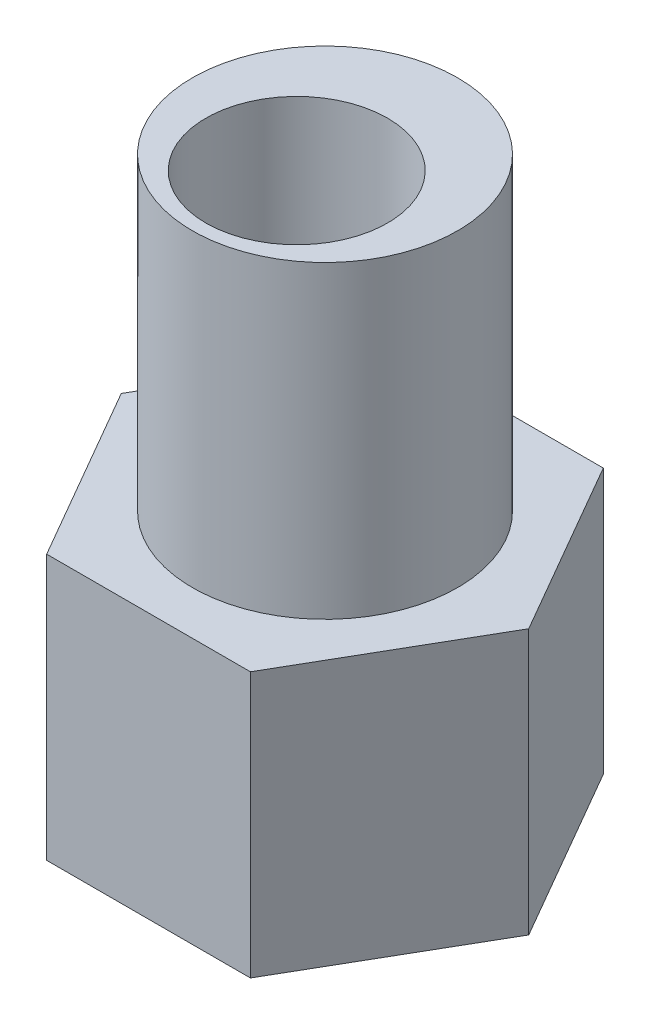
ISO-10303-21;
HEADER;
FILE_DESCRIPTION(('STEP AP214'),'2;1');
FILE_NAME('part.step','',(''),(''),'','','');
FILE_SCHEMA(('AUTOMOTIVE_DESIGN { 1 0 10303 214 1 1 1 1 }'));
ENDSEC;
DATA;
#1=APPLICATION_CONTEXT('core data for automotive mechanical design processes');
#2=APPLICATION_PROTOCOL_DEFINITION('international standard','automotive_design',2000,#1);
#3=PRODUCT_CONTEXT('',#1,'mechanical');
#4=PRODUCT('Part','Part','',(#3));
#5=PRODUCT_RELATED_PRODUCT_CATEGORY('part','',(#4));
#6=PRODUCT_DEFINITION_FORMATION('','',#4);
#7=PRODUCT_DEFINITION_CONTEXT('part definition',#1,'design');
#8=PRODUCT_DEFINITION('design','',#6,#7);
#9=PRODUCT_DEFINITION_SHAPE('','',#8);
#10=(LENGTH_UNIT() NAMED_UNIT(*) SI_UNIT(.MILLI.,.METRE.));
#11=(NAMED_UNIT(*) PLANE_ANGLE_UNIT() SI_UNIT($,.RADIAN.));
#12=(NAMED_UNIT(*) SI_UNIT($,.STERADIAN.) SOLID_ANGLE_UNIT());
#13=UNCERTAINTY_MEASURE_WITH_UNIT(LENGTH_MEASURE(1.E-05),#10,'distance_accuracy_value','');
#14=(GEOMETRIC_REPRESENTATION_CONTEXT(3) GLOBAL_UNCERTAINTY_ASSIGNED_CONTEXT((#13)) GLOBAL_UNIT_ASSIGNED_CONTEXT((#10,
#11,#12)) REPRESENTATION_CONTEXT('',''));
#15=CARTESIAN_POINT('',(0.,0.,0.));
#16=DIRECTION('',(0.,0.,1.));
#17=DIRECTION('',(1.,0.,0.));
#18=AXIS2_PLACEMENT_3D('',#15,#16,#17);
#19=CARTESIAN_POINT('',(0.,9.525,0.));
#20=DIRECTION('',(0.,1.,0.));
#21=DIRECTION('',(0.,0.,1.));
#22=AXIS2_PLACEMENT_3D('',#19,#20,#21);
#23=PLANE('',#22);
#24=CARTESIAN_POINT('',(0.,9.52500000003,0.));
#25=DIRECTION('',(0.,-1.,0.));
#26=DIRECTION('',(0.,0.,-1.));
#27=AXIS2_PLACEMENT_3D('',#24,#25,#26);
#28=CIRCLE('',#27,4.7625);
#29=CARTESIAN_POINT('',(0.,9.52500000003,-4.7625));
#30=VERTEX_POINT('',#29);
#31=EDGE_CURVE('E20',#30,#30,#28,.F.);
#32=ORIENTED_EDGE('',*,*,#31,.F.);
#33=EDGE_LOOP('',(#32));
#34=FACE_BOUND('',#33,.T.);
#35=DIRECTION('',(0.50000000000019,0.,-0.866025403784329));
#36=VECTOR('',#35,1.);
#37=CARTESIAN_POINT('',(-3.65884186094,9.525,-6.3373));
#38=LINE('',#37,#36);
#39=CARTESIAN_POINT('',(-3.65884186123562,9.525,-6.33730000027601));
#40=VERTEX_POINT('',#39);
#41=CARTESIAN_POINT('',(-7.31768372158863,9.525,-2.97582824296916E-10));
#42=VERTEX_POINT('',#41);
#43=EDGE_CURVE('E111',#40,#42,#38,.F.);
#44=ORIENTED_EDGE('',*,*,#43,.T.);
#45=DIRECTION('',(-0.50000000000019,0.,-0.866025403784329));
#46=VECTOR('',#45,1.);
#47=CARTESIAN_POINT('',(-7.31768372187,9.525,0.));
#48=LINE('',#47,#46);
#49=CARTESIAN_POINT('',(-3.6588418609598,9.525,6.33730000034042));
#50=VERTEX_POINT('',#49);
#51=EDGE_CURVE('E106',#42,#50,#48,.F.);
#52=ORIENTED_EDGE('',*,*,#51,.T.);
#53=DIRECTION('',(-1.,0.,0.));
#54=VECTOR('',#53,1.);
#55=CARTESIAN_POINT('',(-3.65884186094,9.525,6.3373));
#56=LINE('',#55,#54);
#57=CARTESIAN_POINT('',(3.65884186123562,9.525,6.33730000045351));
#58=VERTEX_POINT('',#57);
#59=EDGE_CURVE('E72',#50,#58,#56,.F.);
#60=ORIENTED_EDGE('',*,*,#59,.T.);
#61=DIRECTION('',(-0.50000000000019,0.,0.866025403784329));
#62=VECTOR('',#61,1.);
#63=CARTESIAN_POINT('',(3.65884186094,9.525,6.3373));
#64=LINE('',#63,#62);
#65=CARTESIAN_POINT('',(7.31768372158863,9.525,2.97582678169549E-10));
#66=VERTEX_POINT('',#65);
#67=EDGE_CURVE('E71',#58,#66,#64,.F.);
#68=ORIENTED_EDGE('',*,*,#67,.T.);
#69=DIRECTION('',(0.50000000000019,0.,0.866025403784329));
#70=VECTOR('',#69,1.);
#71=CARTESIAN_POINT('',(7.31768372187,9.525,0.));
#72=LINE('',#71,#70);
#73=CARTESIAN_POINT('',(3.6588418610723,9.525,-6.33730000034042));
#74=VERTEX_POINT('',#73);
#75=EDGE_CURVE('E68',#66,#74,#72,.F.);
#76=ORIENTED_EDGE('',*,*,#75,.T.);
#77=DIRECTION('',(1.,0.,0.));
#78=VECTOR('',#77,1.);
#79=CARTESIAN_POINT('',(3.65884186094,9.525,-6.3373));
#80=LINE('',#79,#78);
#81=EDGE_CURVE('E116',#74,#40,#80,.F.);
#82=ORIENTED_EDGE('',*,*,#81,.T.);
#83=EDGE_LOOP('',(#44,#52,#60,#68,#76,#82));
#84=FACE_BOUND('',#83,.T.);
#85=ADVANCED_FACE('F17',(#34,#84),#23,.T.);
#86=CARTESIAN_POINT('',(0.,20.6248,0.));
#87=DIRECTION('',(0.,-1.,0.));
#88=DIRECTION('',(0.,0.,-1.));
#89=AXIS2_PLACEMENT_3D('',#86,#87,#88);
#90=CYLINDRICAL_SURFACE('',#89,4.7625);
#91=ORIENTED_EDGE('',*,*,#31,.T.);
#92=EDGE_LOOP('',(#91));
#93=FACE_BOUND('',#92,.T.);
#94=CARTESIAN_POINT('',(0.,20.6248,0.));
#95=DIRECTION('',(0.,-1.,0.));
#96=DIRECTION('',(0.,0.,-1.));
#97=AXIS2_PLACEMENT_3D('',#94,#95,#96);
#98=CIRCLE('',#97,4.7625);
#99=CARTESIAN_POINT('',(0.,20.6248,-4.7625));
#100=VERTEX_POINT('',#99);
#101=EDGE_CURVE('E94',#100,#100,#98,.F.);
#102=ORIENTED_EDGE('',*,*,#101,.F.);
#103=EDGE_LOOP('',(#102));
#104=FACE_BOUND('',#103,.T.);
#105=ADVANCED_FACE('F223',(#93,#104),#90,.T.);
#106=CARTESIAN_POINT('',(3.65884186094,9.525,6.3373));
#107=DIRECTION('',(-0.866025403784329,0.,-0.50000000000019));
#108=DIRECTION('',(-0.50000000000019,0.,0.866025403784329));
#109=AXIS2_PLACEMENT_3D('',#106,#107,#108);
#110=PLANE('',#109);
#111=DIRECTION('',(0.,1.,0.));
#112=VECTOR('',#111,1.);
#113=CARTESIAN_POINT('',(7.3176837220986,9.525,3.95954338144703E-10));
#114=LINE('',#113,#112);
#115=CARTESIAN_POINT('',(7.31768372170363,-2.79398899849514E-10,4.94519666478076E-10));
#116=VERTEX_POINT('',#115);
#117=EDGE_CURVE('E77',#116,#66,#114,.T.);
#118=ORIENTED_EDGE('',*,*,#117,.T.);
#119=ORIENTED_EDGE('',*,*,#67,.F.);
#120=DIRECTION('',(0.,1.,0.));
#121=VECTOR('',#120,1.);
#122=CARTESIAN_POINT('',(3.65884186141,9.525,6.3373));
#123=LINE('',#122,#121);
#124=CARTESIAN_POINT('',(3.65884186071625,-2.79398032487777E-10,6.33730000019702));
#125=VERTEX_POINT('',#124);
#126=EDGE_CURVE('E96',#58,#125,#123,.F.);
#127=ORIENTED_EDGE('',*,*,#126,.T.);
#128=DIRECTION('',(0.500000000093205,0.,-0.866025403730627));
#129=VECTOR('',#128,1.);
#130=CARTESIAN_POINT('',(3.65884186003,0.,6.3373));
#131=LINE('',#130,#129);
#132=EDGE_CURVE('E88',#125,#116,#131,.T.);
#133=ORIENTED_EDGE('',*,*,#132,.T.);
#134=EDGE_LOOP('',(#118,#119,#127,#133));
#135=FACE_BOUND('',#134,.T.);
#136=ADVANCED_FACE('F87',(#135),#110,.F.);
#137=CARTESIAN_POINT('',(7.31768372187,9.525,0.));
#138=DIRECTION('',(-0.866025403784329,0.,0.50000000000019));
#139=DIRECTION('',(0.50000000000019,0.,0.866025403784329));
#140=AXIS2_PLACEMENT_3D('',#137,#138,#139);
#141=PLANE('',#140);
#142=DIRECTION('',(0.,1.,0.));
#143=VECTOR('',#142,1.);
#144=CARTESIAN_POINT('',(3.65884186139,9.525,-6.3373));
#145=LINE('',#144,#143);
#146=CARTESIAN_POINT('',(3.6588418610673,-2.79398032487777E-10,-6.33729999996542));
#147=VERTEX_POINT('',#146);
#148=EDGE_CURVE('E84',#147,#74,#145,.T.);
#149=ORIENTED_EDGE('',*,*,#148,.T.);
#150=ORIENTED_EDGE('',*,*,#75,.F.);
#151=ORIENTED_EDGE('',*,*,#117,.F.);
#152=DIRECTION('',(-0.499999999907336,0.,-0.866025403837938));
#153=VECTOR('',#152,1.);
#154=CARTESIAN_POINT('',(7.31768372142,0.,7.87746756714E-10));
#155=LINE('',#154,#153);
#156=EDGE_CURVE('E99',#116,#147,#155,.T.);
#157=ORIENTED_EDGE('',*,*,#156,.T.);
#158=EDGE_LOOP('',(#149,#150,#151,#157));
#159=FACE_BOUND('',#158,.T.);
#160=ADVANCED_FACE('F81',(#159),#141,.F.);
#161=CARTESIAN_POINT('',(3.65884186094,9.525,-6.3373));
#162=DIRECTION('',(0.,0.,1.));
#163=DIRECTION('',(1.,0.,0.));
#164=AXIS2_PLACEMENT_3D('',#161,#162,#163);
#165=PLANE('',#164);
#166=DIRECTION('',(0.,1.,0.));
#167=VECTOR('',#166,1.);
#168=CARTESIAN_POINT('',(-3.6588418607125,9.525,-6.33730000039404));
#169=LINE('',#168,#167);
#170=CARTESIAN_POINT('',(-3.65884186100465,-2.79397165126039E-10,-6.33729999990101));
#171=VERTEX_POINT('',#170);
#172=EDGE_CURVE('E113',#171,#40,#169,.T.);
#173=ORIENTED_EDGE('',*,*,#172,.T.);
#174=ORIENTED_EDGE('',*,*,#81,.F.);
#175=ORIENTED_EDGE('',*,*,#148,.F.);
#176=DIRECTION('',(1.,0.,0.));
#177=VECTOR('',#176,1.);
#178=CARTESIAN_POINT('',(0.,0.,-6.33729999921));
#179=LINE('',#178,#177);
#180=EDGE_CURVE('E127',#147,#171,#179,.F.);
#181=ORIENTED_EDGE('',*,*,#180,.T.);
#182=EDGE_LOOP('',(#173,#174,#175,#181));
#183=FACE_BOUND('',#182,.T.);
#184=ADVANCED_FACE('F125',(#183),#165,.F.);
#185=CARTESIAN_POINT('',(-3.65884186094,9.525,-6.3373));
#186=DIRECTION('',(0.866025403784329,0.,0.50000000000019));
#187=DIRECTION('',(0.50000000000019,0.,-0.866025403784329));
#188=AXIS2_PLACEMENT_3D('',#185,#186,#187);
#189=PLANE('',#188);
#190=DIRECTION('',(0.,1.,0.));
#191=VECTOR('',#190,1.);
#192=CARTESIAN_POINT('',(-7.3176837220986,9.525,-3.95954841722088E-10));
#193=LINE('',#192,#191);
#194=CARTESIAN_POINT('',(-7.31768372170363,-2.79398032487777E-10,-4.94519004770535E-10));
#195=VERTEX_POINT('',#194);
#196=EDGE_CURVE('E108',#195,#42,#193,.T.);
#197=ORIENTED_EDGE('',*,*,#196,.T.);
#198=ORIENTED_EDGE('',*,*,#43,.F.);
#199=ORIENTED_EDGE('',*,*,#172,.F.);
#200=DIRECTION('',(-0.500000000093205,0.,0.866025403730627));
#201=VECTOR('',#200,1.);
#202=CARTESIAN_POINT('',(-3.65884186003,0.,-6.3373));
#203=LINE('',#202,#201);
#204=EDGE_CURVE('E129',#171,#195,#203,.T.);
#205=ORIENTED_EDGE('',*,*,#204,.T.);
#206=EDGE_LOOP('',(#197,#198,#199,#205));
#207=FACE_BOUND('',#206,.T.);
#208=ADVANCED_FACE('F121',(#207),#189,.F.);
#209=CARTESIAN_POINT('',(-7.31768372187,9.525,0.));
#210=DIRECTION('',(0.866025403784329,0.,-0.50000000000019));
#211=DIRECTION('',(-0.50000000000019,0.,-0.866025403784329));
#212=AXIS2_PLACEMENT_3D('',#209,#210,#211);
#213=PLANE('',#212);
#214=DIRECTION('',(0.,1.,0.));
#215=VECTOR('',#214,1.);
#216=CARTESIAN_POINT('',(-3.65884186094,9.525,6.3373));
#217=LINE('',#216,#215);
#218=CARTESIAN_POINT('',(-3.6588418608423,-2.79396297764301E-10,6.33730000016292));
#219=VERTEX_POINT('',#218);
#220=EDGE_CURVE('E35',#219,#50,#217,.T.);
#221=ORIENTED_EDGE('',*,*,#220,.T.);
#222=ORIENTED_EDGE('',*,*,#51,.F.);
#223=ORIENTED_EDGE('',*,*,#196,.F.);
#224=DIRECTION('',(0.49999999990671,0.,0.8660254038383));
#225=VECTOR('',#224,1.);
#226=CARTESIAN_POINT('',(-7.31768372142,0.,-7.87746756714E-10));
#227=LINE('',#226,#225);
#228=EDGE_CURVE('E131',#195,#219,#227,.T.);
#229=ORIENTED_EDGE('',*,*,#228,.T.);
#230=EDGE_LOOP('',(#221,#222,#223,#229));
#231=FACE_BOUND('',#230,.T.);
#232=ADVANCED_FACE('F140',(#231),#213,.F.);
#233=CARTESIAN_POINT('',(-3.65884186094,9.525,6.3373));
#234=DIRECTION('',(0.,0.,-1.));
#235=DIRECTION('',(-1.,0.,0.));
#236=AXIS2_PLACEMENT_3D('',#233,#234,#235);
#237=PLANE('',#236);
#238=ORIENTED_EDGE('',*,*,#126,.F.);
#239=ORIENTED_EDGE('',*,*,#59,.F.);
#240=ORIENTED_EDGE('',*,*,#220,.F.);
#241=DIRECTION('',(1.,0.,0.));
#242=VECTOR('',#241,1.);
#243=CARTESIAN_POINT('',(0.,0.,6.3373));
#244=LINE('',#243,#242);
#245=EDGE_CURVE('E93',#219,#125,#244,.T.);
#246=ORIENTED_EDGE('',*,*,#245,.T.);
#247=EDGE_LOOP('',(#238,#239,#240,#246));
#248=FACE_BOUND('',#247,.T.);
#249=ADVANCED_FACE('F136',(#248),#237,.F.);
#250=CARTESIAN_POINT('',(0.,20.6248,0.));
#251=DIRECTION('',(0.,1.,0.));
#252=DIRECTION('',(0.,0.,1.));
#253=AXIS2_PLACEMENT_3D('',#250,#251,#252);
#254=PLANE('',#253);
#255=CARTESIAN_POINT('',(0.,20.6248000003,1.016));
#256=DIRECTION('',(0.,1.,0.));
#257=DIRECTION('',(0.,0.,1.));
#258=AXIS2_PLACEMENT_3D('',#255,#256,#257);
#259=CIRCLE('',#258,3.2639);
#260=CARTESIAN_POINT('',(0.,20.6248000003,4.2799));
#261=VERTEX_POINT('',#260);
#262=EDGE_CURVE('E26',#261,#261,#259,.F.);
#263=ORIENTED_EDGE('',*,*,#262,.T.);
#264=EDGE_LOOP('',(#263));
#265=FACE_BOUND('',#264,.T.);
#266=ORIENTED_EDGE('',*,*,#101,.T.);
#267=EDGE_LOOP('',(#266));
#268=FACE_BOUND('',#267,.T.);
#269=ADVANCED_FACE('F148',(#265,#268),#254,.T.);
#270=CARTESIAN_POINT('',(0.,0.,0.));
#271=DIRECTION('',(0.,1.,0.));
#272=DIRECTION('',(0.,0.,1.));
#273=AXIS2_PLACEMENT_3D('',#270,#271,#272);
#274=PLANE('',#273);
#275=CARTESIAN_POINT('',(0.,0.,1.016));
#276=DIRECTION('',(0.,1.,0.));
#277=DIRECTION('',(0.,0.,1.));
#278=AXIS2_PLACEMENT_3D('',#275,#276,#277);
#279=CIRCLE('',#278,3.2639);
#280=CARTESIAN_POINT('',(0.,0.,4.2799));
#281=VERTEX_POINT('',#280);
#282=EDGE_CURVE('E11',#281,#281,#279,.T.);
#283=ORIENTED_EDGE('',*,*,#282,.T.);
#284=EDGE_LOOP('',(#283));
#285=FACE_BOUND('',#284,.T.);
#286=ORIENTED_EDGE('',*,*,#228,.F.);
#287=ORIENTED_EDGE('',*,*,#204,.F.);
#288=ORIENTED_EDGE('',*,*,#180,.F.);
#289=ORIENTED_EDGE('',*,*,#156,.F.);
#290=ORIENTED_EDGE('',*,*,#132,.F.);
#291=ORIENTED_EDGE('',*,*,#245,.F.);
#292=EDGE_LOOP('',(#286,#287,#288,#289,#290,#291));
#293=FACE_BOUND('',#292,.T.);
#294=ADVANCED_FACE('F138',(#285,#293),#274,.F.);
#295=CARTESIAN_POINT('',(0.,0.,1.016));
#296=DIRECTION('',(0.,1.,0.));
#297=DIRECTION('',(0.,0.,1.));
#298=AXIS2_PLACEMENT_3D('',#295,#296,#297);
#299=CYLINDRICAL_SURFACE('',#298,3.2639);
#300=ORIENTED_EDGE('',*,*,#262,.F.);
#301=EDGE_LOOP('',(#300));
#302=FACE_BOUND('',#301,.T.);
#303=ORIENTED_EDGE('',*,*,#282,.F.);
#304=EDGE_LOOP('',(#303));
#305=FACE_BOUND('',#304,.T.);
#306=ADVANCED_FACE('F151',(#302,#305),#299,.F.);
#307=CLOSED_SHELL('',(#85,#105,#136,#160,#184,#208,#232,#249,#269,#294,#306));
#308=MANIFOLD_SOLID_BREP('B1',#307);
#309=ADVANCED_BREP_SHAPE_REPRESENTATION('',(#18,#308),#14);
#310=SHAPE_DEFINITION_REPRESENTATION(#9,#309);
ENDSEC;
END-ISO-10303-21;
